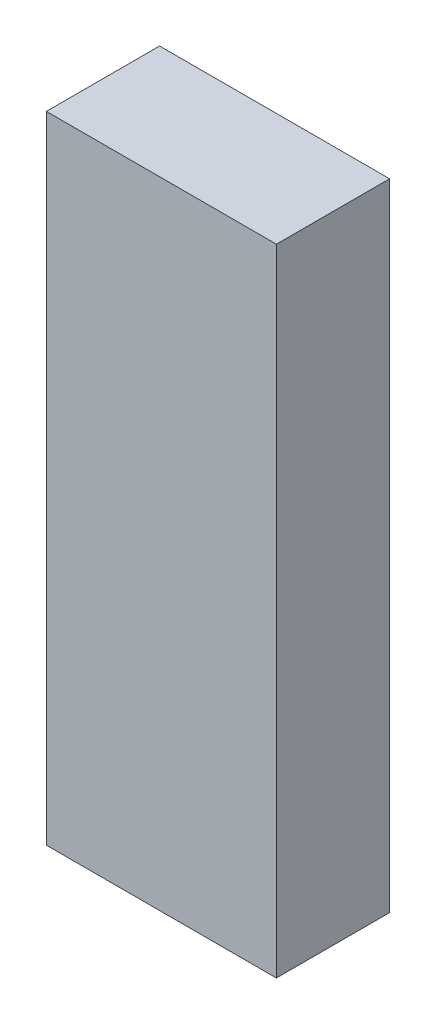
ISO-10303-21;
HEADER;
FILE_DESCRIPTION(('STEP AP214'),'2;1');
FILE_NAME('part.step','',(''),(''),'','','');
FILE_SCHEMA(('AUTOMOTIVE_DESIGN { 1 0 10303 214 1 1 1 1 }'));
ENDSEC;
DATA;
#1=APPLICATION_CONTEXT('core data for automotive mechanical design processes');
#2=APPLICATION_PROTOCOL_DEFINITION('international standard','automotive_design',2000,#1);
#3=PRODUCT_CONTEXT('',#1,'mechanical');
#4=PRODUCT('Part','Part','',(#3));
#5=PRODUCT_RELATED_PRODUCT_CATEGORY('part','',(#4));
#6=PRODUCT_DEFINITION_FORMATION('','',#4);
#7=PRODUCT_DEFINITION_CONTEXT('part definition',#1,'design');
#8=PRODUCT_DEFINITION('design','',#6,#7);
#9=PRODUCT_DEFINITION_SHAPE('','',#8);
#10=(LENGTH_UNIT() NAMED_UNIT(*) SI_UNIT(.MILLI.,.METRE.));
#11=(NAMED_UNIT(*) PLANE_ANGLE_UNIT() SI_UNIT($,.RADIAN.));
#12=(NAMED_UNIT(*) SI_UNIT($,.STERADIAN.) SOLID_ANGLE_UNIT());
#13=UNCERTAINTY_MEASURE_WITH_UNIT(LENGTH_MEASURE(1.E-05),#10,'distance_accuracy_value','');
#14=(GEOMETRIC_REPRESENTATION_CONTEXT(3) GLOBAL_UNCERTAINTY_ASSIGNED_CONTEXT((#13)) GLOBAL_UNIT_ASSIGNED_CONTEXT((#10,
#11,#12)) REPRESENTATION_CONTEXT('',''));
#15=CARTESIAN_POINT('',(0.,0.,0.));
#16=DIRECTION('',(0.,0.,1.));
#17=DIRECTION('',(1.,0.,0.));
#18=AXIS2_PLACEMENT_3D('',#15,#16,#17);
#19=CARTESIAN_POINT('',(-0.32500316,-2.34697778,0.31999936));
#20=DIRECTION('',(0.,0.,-1.));
#21=DIRECTION('',(-1.,0.,0.));
#22=AXIS2_PLACEMENT_3D('',#19,#20,#21);
#23=PLANE('',#22);
#24=DIRECTION('',(0.,1.,0.));
#25=VECTOR('',#24,1.);
#26=CARTESIAN_POINT('',(0.32499808,-4.1428035,0.31999936));
#27=LINE('',#26,#25);
#28=CARTESIAN_POINT('',(0.32499808,-4.1428035,0.31999936));
#29=VERTEX_POINT('',#28);
#30=CARTESIAN_POINT('',(0.32499808,-2.34697778,0.31999936));
#31=VERTEX_POINT('',#30);
#32=EDGE_CURVE('E79',#29,#31,#27,.T.);
#33=ORIENTED_EDGE('',*,*,#32,.T.);
#34=DIRECTION('',(1.,0.,0.));
#35=VECTOR('',#34,1.);
#36=CARTESIAN_POINT('',(0.32499808,-2.34697778,0.31999936));
#37=LINE('',#36,#35);
#38=CARTESIAN_POINT('',(-0.32500316,-2.34697778,0.31999936));
#39=VERTEX_POINT('',#38);
#40=EDGE_CURVE('E54',#31,#39,#37,.F.);
#41=ORIENTED_EDGE('',*,*,#40,.T.);
#42=DIRECTION('',(0.,1.,0.));
#43=VECTOR('',#42,1.);
#44=CARTESIAN_POINT('',(-0.32500316,-2.34697778,0.31999936));
#45=LINE('',#44,#43);
#46=CARTESIAN_POINT('',(-0.32500316,-4.1428035,0.31999936));
#47=VERTEX_POINT('',#46);
#48=EDGE_CURVE('E56',#39,#47,#45,.F.);
#49=ORIENTED_EDGE('',*,*,#48,.T.);
#50=DIRECTION('',(1.,0.,0.));
#51=VECTOR('',#50,1.);
#52=CARTESIAN_POINT('',(-0.32500316,-4.1428035,0.31999936));
#53=LINE('',#52,#51);
#54=EDGE_CURVE('E19',#47,#29,#53,.T.);
#55=ORIENTED_EDGE('',*,*,#54,.T.);
#56=EDGE_LOOP('',(#33,#41,#49,#55));
#57=FACE_BOUND('',#56,.T.);
#58=ADVANCED_FACE('F16',(#57),#23,.F.);
#59=CARTESIAN_POINT('',(-0.32500316,-4.1428035,0.));
#60=DIRECTION('',(0.,1.,0.));
#61=DIRECTION('',(0.,0.,1.));
#62=AXIS2_PLACEMENT_3D('',#59,#60,#61);
#63=PLANE('',#62);
#64=ORIENTED_EDGE('',*,*,#54,.F.);
#65=DIRECTION('',(0.,0.,-1.));
#66=VECTOR('',#65,1.);
#67=CARTESIAN_POINT('',(-0.32500316,-4.1428035,0.));
#68=LINE('',#67,#66);
#69=CARTESIAN_POINT('',(-0.32500316,-4.1428035,0.));
#70=VERTEX_POINT('',#69);
#71=EDGE_CURVE('E62',#47,#70,#68,.T.);
#72=ORIENTED_EDGE('',*,*,#71,.T.);
#73=DIRECTION('',(-1.,0.,0.));
#74=VECTOR('',#73,1.);
#75=CARTESIAN_POINT('',(-0.32500316,-4.1428035,0.));
#76=LINE('',#75,#74);
#77=CARTESIAN_POINT('',(0.32499808,-4.1428035,0.));
#78=VERTEX_POINT('',#77);
#79=EDGE_CURVE('E82',#78,#70,#76,.T.);
#80=ORIENTED_EDGE('',*,*,#79,.F.);
#81=DIRECTION('',(0.,0.,1.));
#82=VECTOR('',#81,1.);
#83=CARTESIAN_POINT('',(0.32499808,-4.1428035,0.));
#84=LINE('',#83,#82);
#85=EDGE_CURVE('E67',#78,#29,#84,.T.);
#86=ORIENTED_EDGE('',*,*,#85,.T.);
#87=EDGE_LOOP('',(#64,#72,#80,#86));
#88=FACE_BOUND('',#87,.T.);
#89=ADVANCED_FACE('F64',(#88),#63,.F.);
#90=CARTESIAN_POINT('',(-0.32500316,-2.34697778,0.));
#91=DIRECTION('',(1.,0.,0.));
#92=DIRECTION('',(0.,0.,-1.));
#93=AXIS2_PLACEMENT_3D('',#90,#91,#92);
#94=PLANE('',#93);
#95=ORIENTED_EDGE('',*,*,#48,.F.);
#96=DIRECTION('',(0.,0.,-1.));
#97=VECTOR('',#96,1.);
#98=CARTESIAN_POINT('',(-0.32500316,-2.34697778,0.));
#99=LINE('',#98,#97);
#100=CARTESIAN_POINT('',(-0.32500316,-2.34697778,0.));
#101=VERTEX_POINT('',#100);
#102=EDGE_CURVE('E74',#39,#101,#99,.T.);
#103=ORIENTED_EDGE('',*,*,#102,.T.);
#104=DIRECTION('',(0.,1.,0.));
#105=VECTOR('',#104,1.);
#106=CARTESIAN_POINT('',(-0.32500316,-2.34697778,0.));
#107=LINE('',#106,#105);
#108=EDGE_CURVE('E71',#70,#101,#107,.T.);
#109=ORIENTED_EDGE('',*,*,#108,.F.);
#110=ORIENTED_EDGE('',*,*,#71,.F.);
#111=EDGE_LOOP('',(#95,#103,#109,#110));
#112=FACE_BOUND('',#111,.T.);
#113=ADVANCED_FACE('F69',(#112),#94,.F.);
#114=CARTESIAN_POINT('',(0.32499808,-2.34697778,0.));
#115=DIRECTION('',(0.,-1.,0.));
#116=DIRECTION('',(0.,0.,-1.));
#117=AXIS2_PLACEMENT_3D('',#114,#115,#116);
#118=PLANE('',#117);
#119=ORIENTED_EDGE('',*,*,#40,.F.);
#120=DIRECTION('',(0.,0.,1.));
#121=VECTOR('',#120,1.);
#122=CARTESIAN_POINT('',(0.32499808,-2.34697778,0.));
#123=LINE('',#122,#121);
#124=CARTESIAN_POINT('',(0.32499808,-2.34697778,0.));
#125=VERTEX_POINT('',#124);
#126=EDGE_CURVE('E34',#31,#125,#123,.F.);
#127=ORIENTED_EDGE('',*,*,#126,.T.);
#128=DIRECTION('',(-1.,0.,0.));
#129=VECTOR('',#128,1.);
#130=CARTESIAN_POINT('',(-0.32500316,-2.34697778,0.));
#131=LINE('',#130,#129);
#132=EDGE_CURVE('E25',#101,#125,#131,.F.);
#133=ORIENTED_EDGE('',*,*,#132,.F.);
#134=ORIENTED_EDGE('',*,*,#102,.F.);
#135=EDGE_LOOP('',(#119,#127,#133,#134));
#136=FACE_BOUND('',#135,.T.);
#137=ADVANCED_FACE('F88',(#136),#118,.F.);
#138=CARTESIAN_POINT('',(0.32499808,-4.1428035,0.));
#139=DIRECTION('',(-1.,0.,0.));
#140=DIRECTION('',(0.,0.,1.));
#141=AXIS2_PLACEMENT_3D('',#138,#139,#140);
#142=PLANE('',#141);
#143=ORIENTED_EDGE('',*,*,#32,.F.);
#144=ORIENTED_EDGE('',*,*,#85,.F.);
#145=DIRECTION('',(0.,1.,0.));
#146=VECTOR('',#145,1.);
#147=CARTESIAN_POINT('',(0.32499808,-2.34697778,0.));
#148=LINE('',#147,#146);
#149=EDGE_CURVE('E11',#125,#78,#148,.F.);
#150=ORIENTED_EDGE('',*,*,#149,.F.);
#151=ORIENTED_EDGE('',*,*,#126,.F.);
#152=EDGE_LOOP('',(#143,#144,#150,#151));
#153=FACE_BOUND('',#152,.T.);
#154=ADVANCED_FACE('F90',(#153),#142,.F.);
#155=CARTESIAN_POINT('',(-0.32500316,-2.34697778,0.));
#156=DIRECTION('',(0.,0.,-1.));
#157=DIRECTION('',(-1.,0.,0.));
#158=AXIS2_PLACEMENT_3D('',#155,#156,#157);
#159=PLANE('',#158);
#160=ORIENTED_EDGE('',*,*,#132,.T.);
#161=ORIENTED_EDGE('',*,*,#149,.T.);
#162=ORIENTED_EDGE('',*,*,#79,.T.);
#163=ORIENTED_EDGE('',*,*,#108,.T.);
#164=EDGE_LOOP('',(#160,#161,#162,#163));
#165=FACE_BOUND('',#164,.T.);
#166=ADVANCED_FACE('F87',(#165),#159,.T.);
#167=CLOSED_SHELL('',(#58,#89,#113,#137,#154,#166));
#168=MANIFOLD_SOLID_BREP('B1',#167);
#169=ADVANCED_BREP_SHAPE_REPRESENTATION('',(#18,#168),#14);
#170=SHAPE_DEFINITION_REPRESENTATION(#9,#169);
ENDSEC;
END-ISO-10303-21;
